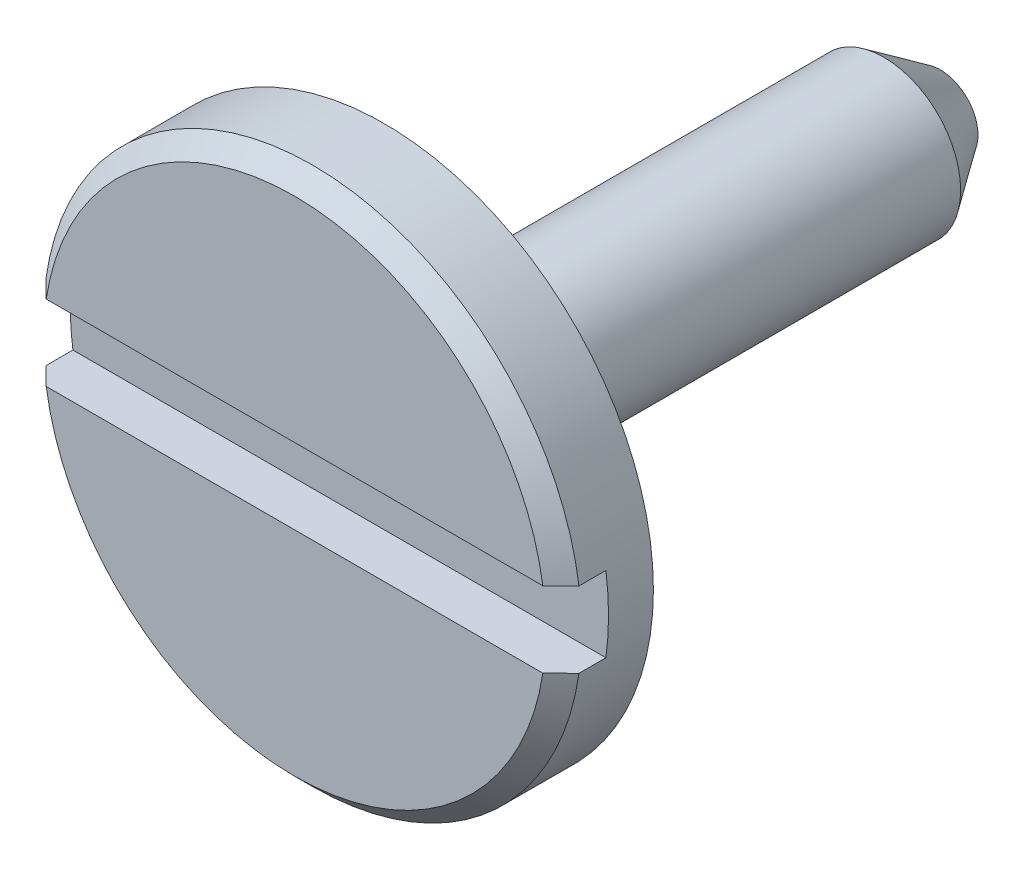
ISO-10303-21;
HEADER;
FILE_DESCRIPTION(('STEP AP214'),'2;1');
FILE_NAME('part.step','',(''),(''),'','','');
FILE_SCHEMA(('AUTOMOTIVE_DESIGN { 1 0 10303 214 1 1 1 1 }'));
ENDSEC;
DATA;
#1=APPLICATION_CONTEXT('core data for automotive mechanical design processes');
#2=APPLICATION_PROTOCOL_DEFINITION('international standard','automotive_design',2000,#1);
#3=PRODUCT_CONTEXT('',#1,'mechanical');
#4=PRODUCT('Part','Part','',(#3));
#5=PRODUCT_RELATED_PRODUCT_CATEGORY('part','',(#4));
#6=PRODUCT_DEFINITION_FORMATION('','',#4);
#7=PRODUCT_DEFINITION_CONTEXT('part definition',#1,'design');
#8=PRODUCT_DEFINITION('design','',#6,#7);
#9=PRODUCT_DEFINITION_SHAPE('','',#8);
#10=(LENGTH_UNIT() NAMED_UNIT(*) SI_UNIT(.MILLI.,.METRE.));
#11=(NAMED_UNIT(*) PLANE_ANGLE_UNIT() SI_UNIT($,.RADIAN.));
#12=(NAMED_UNIT(*) SI_UNIT($,.STERADIAN.) SOLID_ANGLE_UNIT());
#13=UNCERTAINTY_MEASURE_WITH_UNIT(LENGTH_MEASURE(1.E-05),#10,'distance_accuracy_value','');
#14=(GEOMETRIC_REPRESENTATION_CONTEXT(3) GLOBAL_UNCERTAINTY_ASSIGNED_CONTEXT((#13)) GLOBAL_UNIT_ASSIGNED_CONTEXT((#10,
#11,#12)) REPRESENTATION_CONTEXT('',''));
#15=CARTESIAN_POINT('',(0.,0.,0.));
#16=DIRECTION('',(0.,0.,1.));
#17=DIRECTION('',(1.,0.,0.));
#18=AXIS2_PLACEMENT_3D('',#15,#16,#17);
#19=CARTESIAN_POINT('',(-50.26622772217,-10.938681604222,15.5689026905811));
#20=DIRECTION('',(0.,0.,-1.));
#21=DIRECTION('',(-1.,0.,0.));
#22=AXIS2_PLACEMENT_3D('',#19,#20,#21);
#23=PLANE('',#22);
#24=CARTESIAN_POINT('',(-50.26622772217,-10.938681604222,15.5689026905811));
#25=DIRECTION('',(0.,0.,-1.));
#26=DIRECTION('',(-1.,0.,0.));
#27=AXIS2_PLACEMENT_3D('',#24,#25,#26);
#28=CIRCLE('',#27,0.732);
#29=CARTESIAN_POINT('',(-50.9909649892266,-11.0415396540619,15.5689026905811));
#30=VERTEX_POINT('',#29);
#31=CARTESIAN_POINT('',(-50.9909650687875,-10.8358235543796,15.5689026905811));
#32=VERTEX_POINT('',#31);
#33=EDGE_CURVE('E99',#30,#32,#28,.T.);
#34=ORIENTED_EDGE('',*,*,#33,.F.);
#35=DIRECTION('',(1.,0.,0.));
#36=VECTOR('',#35,1.);
#37=CARTESIAN_POINT('',(-50.26622772217,-11.0415396540619,15.5689026905811));
#38=LINE('',#37,#36);
#39=CARTESIAN_POINT('',(-49.541490375551,-11.0415396540619,15.5689026905811));
#40=VERTEX_POINT('',#39);
#41=EDGE_CURVE('E101',#30,#40,#38,.T.);
#42=ORIENTED_EDGE('',*,*,#41,.T.);
#43=CARTESIAN_POINT('',(-50.26622772217,-10.938681604222,15.5689026905811));
#44=DIRECTION('',(0.,0.,-1.));
#45=DIRECTION('',(-1.,0.,0.));
#46=AXIS2_PLACEMENT_3D('',#43,#44,#45);
#47=CIRCLE('',#46,0.732);
#48=CARTESIAN_POINT('',(-49.5414904551135,-10.8358235543796,15.5689026905811));
#49=VERTEX_POINT('',#48);
#50=EDGE_CURVE('E40',#49,#40,#47,.T.);
#51=ORIENTED_EDGE('',*,*,#50,.F.);
#52=DIRECTION('',(1.,0.,0.));
#53=VECTOR('',#52,1.);
#54=CARTESIAN_POINT('',(-50.26622772217,-10.8358235543796,15.5689026905811));
#55=LINE('',#54,#53);
#56=EDGE_CURVE('E118',#49,#32,#55,.F.);
#57=ORIENTED_EDGE('',*,*,#56,.T.);
#58=EDGE_LOOP('',(#34,#42,#51,#57));
#59=FACE_BOUND('',#58,.T.);
#60=ADVANCED_FACE('F37',(#59),#23,.F.);
#61=CARTESIAN_POINT('',(-50.26622772217,-10.8358235543796,15.5689026905811));
#62=DIRECTION('',(0.,1.,0.));
#63=DIRECTION('',(0.,0.,1.));
#64=AXIS2_PLACEMENT_3D('',#61,#62,#63);
#65=PLANE('',#64);
#66=ORIENTED_EDGE('',*,*,#56,.F.);
#67=DIRECTION('',(0.,0.,1.));
#68=VECTOR('',#67,1.);
#69=CARTESIAN_POINT('',(-49.5414905346749,-10.8358235543796,15.5689026905811));
#70=LINE('',#69,#68);
#71=CARTESIAN_POINT('',(-49.5414903755522,-10.8358235543796,15.6421026905805));
#72=VERTEX_POINT('',#71);
#73=EDGE_CURVE('E95',#72,#49,#70,.F.);
#74=ORIENTED_EDGE('',*,*,#73,.F.);
#75=CARTESIAN_POINT('',(-49.5908149138944,-10.8358235543796,15.6909026905805));
#76=CARTESIAN_POINT('',(-49.5825898081794,-10.8358235543796,15.6827711166603));
#77=CARTESIAN_POINT('',(-49.574366218234,-10.8358235543796,15.6746380106781));
#78=CARTESIAN_POINT('',(-49.5579220699022,-10.8358235543796,15.6583687346091));
#79=CARTESIAN_POINT('',(-49.5497015115157,-10.8358235543796,15.6502325645223));
#80=CARTESIAN_POINT('',(-49.5414824688989,-10.8358235543796,15.6420948623735));
#81=B_SPLINE_CURVE_WITH_KNOTS('',3,(#75,#76,#77,#78,#79,#80),.UNSPECIFIED.,.F.,.F.,(4,2,4),(0.,
0.0346983227341888,0.0693966453852883),.UNSPECIFIED.);
#82=CARTESIAN_POINT('',(-49.5908149138942,-10.8358235543796,15.6909026905803));
#83=VERTEX_POINT('',#82);
#84=EDGE_CURVE('E120',#83,#72,#81,.T.);
#85=ORIENTED_EDGE('',*,*,#84,.F.);
#86=DIRECTION('',(1.,0.,0.));
#87=VECTOR('',#86,1.);
#88=CARTESIAN_POINT('',(-49.90022772217,-10.8358235543796,15.6909026905811));
#89=LINE('',#88,#87);
#90=CARTESIAN_POINT('',(-50.9416405304458,-10.8358235543796,15.6909026905803));
#91=VERTEX_POINT('',#90);
#92=EDGE_CURVE('E108',#91,#83,#89,.T.);
#93=ORIENTED_EDGE('',*,*,#92,.F.);
#94=CARTESIAN_POINT('',(-50.9909730816409,-10.8358235543796,15.6420947572274));
#95=CARTESIAN_POINT('',(-50.9827540213364,-10.8358235543796,15.6502324769131));
#96=CARTESIAN_POINT('',(-50.9745334452562,-10.8358235543796,15.6583686645305));
#97=CARTESIAN_POINT('',(-50.9580892615244,-10.8358235543796,15.6746379756482));
#98=CARTESIAN_POINT('',(-50.9498656538729,-10.8358235543796,15.6827710991485));
#99=CARTESIAN_POINT('',(-50.9416405304456,-10.8358235543796,15.6909026905805));
#100=B_SPLINE_CURVE_WITH_KNOTS('',3,(#94,#95,#96,#97,#98,#99),.UNSPECIFIED.,.F.,.F.,(4,2,4),(0.,
0.0346983973740603,0.0693967948312197),.UNSPECIFIED.);
#101=CARTESIAN_POINT('',(-50.9909650687898,-10.8358235543796,15.6421026905786));
#102=VERTEX_POINT('',#101);
#103=EDGE_CURVE('E171',#102,#91,#100,.T.);
#104=ORIENTED_EDGE('',*,*,#103,.F.);
#105=DIRECTION('',(0.,0.,1.));
#106=VECTOR('',#105,1.);
#107=CARTESIAN_POINT('',(-50.9909650687873,-10.8358235543796,15.5689026905811));
#108=LINE('',#107,#106);
#109=EDGE_CURVE('E116',#32,#102,#108,.T.);
#110=ORIENTED_EDGE('',*,*,#109,.F.);
#111=EDGE_LOOP('',(#66,#74,#85,#93,#104,#110));
#112=FACE_BOUND('',#111,.T.);
#113=ADVANCED_FACE('F175',(#112),#65,.F.);
#114=CARTESIAN_POINT('',(-50.26622772217,-11.0415396540619,15.5689026905811));
#115=DIRECTION('',(0.,-1.,0.));
#116=DIRECTION('',(0.,0.,-1.));
#117=AXIS2_PLACEMENT_3D('',#114,#115,#116);
#118=PLANE('',#117);
#119=ORIENTED_EDGE('',*,*,#41,.F.);
#120=DIRECTION('',(0.,0.,-1.));
#121=VECTOR('',#120,1.);
#122=CARTESIAN_POINT('',(-50.9909649096651,-11.0415396540619,15.5689026905811));
#123=LINE('',#122,#121);
#124=CARTESIAN_POINT('',(-50.9909650687881,-11.0415396540619,15.6421026905805));
#125=VERTEX_POINT('',#124);
#126=EDGE_CURVE('E103',#125,#30,#123,.T.);
#127=ORIENTED_EDGE('',*,*,#126,.F.);
#128=CARTESIAN_POINT('',(-50.9416405304458,-11.0415396540619,15.6909026905806));
#129=CARTESIAN_POINT('',(-50.9498656361608,-11.0415396540619,15.6827711166604));
#130=CARTESIAN_POINT('',(-50.9580892261062,-11.0415396540619,15.6746380106782));
#131=CARTESIAN_POINT('',(-50.974533374438,-11.0415396540619,15.6583687346092));
#132=CARTESIAN_POINT('',(-50.9827539328245,-11.0415396540619,15.6502325645224));
#133=CARTESIAN_POINT('',(-50.9909729754414,-11.0415396540619,15.6420948623736));
#134=B_SPLINE_CURVE_WITH_KNOTS('',3,(#128,#129,#130,#131,#132,#133),.UNSPECIFIED.,.F.,.F.,(4,2,
4),(0.,0.0346983227342182,0.0693966453853323),.UNSPECIFIED.);
#135=CARTESIAN_POINT('',(-50.9416405304461,-11.0415396540619,15.6909026905804));
#136=VERTEX_POINT('',#135);
#137=EDGE_CURVE('E55',#136,#125,#134,.T.);
#138=ORIENTED_EDGE('',*,*,#137,.F.);
#139=DIRECTION('',(1.,0.,0.));
#140=VECTOR('',#139,1.);
#141=CARTESIAN_POINT('',(-49.90022772217,-11.0415396540619,15.6909026905811));
#142=LINE('',#141,#140);
#143=CARTESIAN_POINT('',(-49.5908149138939,-11.0415396540619,15.6909026905804));
#144=VERTEX_POINT('',#143);
#145=EDGE_CURVE('E111',#144,#136,#142,.F.);
#146=ORIENTED_EDGE('',*,*,#145,.F.);
#147=CARTESIAN_POINT('',(-49.5414823626974,-11.0415396540619,15.6420947572261));
#148=CARTESIAN_POINT('',(-49.5497014230021,-11.0415396540619,15.650232476912));
#149=CARTESIAN_POINT('',(-49.5579219990826,-11.0415396540619,15.6583686645297));
#150=CARTESIAN_POINT('',(-49.5743661828148,-11.0415396540619,15.6746379756478));
#151=CARTESIAN_POINT('',(-49.5825897904666,-11.0415396540619,15.6827710991484));
#152=CARTESIAN_POINT('',(-49.5908149138942,-11.0415396540619,15.6909026905806));
#153=B_SPLINE_CURVE_WITH_KNOTS('',3,(#147,#148,#149,#150,#151,#152),.UNSPECIFIED.,.F.,.F.,(4,2,
4),(0.,0.0346983973750881,0.0693967948332755),.UNSPECIFIED.);
#154=CARTESIAN_POINT('',(-49.5414903755501,-11.0415396540619,15.6421026905788));
#155=VERTEX_POINT('',#154);
#156=EDGE_CURVE('E107',#155,#144,#153,.T.);
#157=ORIENTED_EDGE('',*,*,#156,.F.);
#158=DIRECTION('',(0.,0.,-1.));
#159=VECTOR('',#158,1.);
#160=CARTESIAN_POINT('',(-49.5414903755503,-11.0415396540619,15.5689026905811));
#161=LINE('',#160,#159);
#162=EDGE_CURVE('E91',#40,#155,#161,.F.);
#163=ORIENTED_EDGE('',*,*,#162,.F.);
#164=EDGE_LOOP('',(#119,#127,#138,#146,#157,#163));
#165=FACE_BOUND('',#164,.T.);
#166=ADVANCED_FACE('F106',(#165),#118,.F.);
#167=CARTESIAN_POINT('',(-49.90022772217,-10.938681604222,15.6909026905811));
#168=DIRECTION('',(0.,0.,1.));
#169=DIRECTION('',(1.,0.,0.));
#170=AXIS2_PLACEMENT_3D('',#167,#168,#169);
#171=PLANE('',#170);
#172=ORIENTED_EDGE('',*,*,#92,.T.);
#173=CARTESIAN_POINT('',(-50.26622772217,-10.938681604222,15.6909026905801));
#174=DIRECTION('',(0.,0.,-1.));
#175=DIRECTION('',(-1.,0.,0.));
#176=AXIS2_PLACEMENT_3D('',#173,#174,#175);
#177=CIRCLE('',#176,0.683200000000429);
#178=EDGE_CURVE('E135',#91,#83,#177,.T.);
#179=ORIENTED_EDGE('',*,*,#178,.F.);
#180=EDGE_LOOP('',(#172,#179));
#181=FACE_BOUND('',#180,.T.);
#182=ADVANCED_FACE('F184',(#181),#171,.T.);
#183=CARTESIAN_POINT('',(-49.90022772217,-10.938681604222,15.6909026905811));
#184=DIRECTION('',(0.,0.,1.));
#185=DIRECTION('',(1.,0.,0.));
#186=AXIS2_PLACEMENT_3D('',#183,#184,#185);
#187=PLANE('',#186);
#188=ORIENTED_EDGE('',*,*,#145,.T.);
#189=CARTESIAN_POINT('',(-50.26622772217,-10.938681604222,15.6909026905801));
#190=DIRECTION('',(0.,0.,-1.));
#191=DIRECTION('',(-1.,0.,0.));
#192=AXIS2_PLACEMENT_3D('',#189,#190,#191);
#193=CIRCLE('',#192,0.683200000000429);
#194=EDGE_CURVE('E132',#144,#136,#193,.T.);
#195=ORIENTED_EDGE('',*,*,#194,.F.);
#196=EDGE_LOOP('',(#188,#195));
#197=FACE_BOUND('',#196,.T.);
#198=ADVANCED_FACE('F211',(#197),#187,.T.);
#199=CARTESIAN_POINT('',(-50.2150435457344,-10.938681604222,13.9344871517934));
#200=DIRECTION('',(0.,0.,-1.));
#201=DIRECTION('',(-1.,0.,0.));
#202=AXIS2_PLACEMENT_3D('',#199,#200,#201);
#203=PLANE('',#202);
#204=CARTESIAN_POINT('',(-50.26622772217,-10.938681604222,13.9344871517995));
#205=DIRECTION('',(0.,0.,1.));
#206=DIRECTION('',(1.,0.,0.));
#207=AXIS2_PLACEMENT_3D('',#204,#205,#206);
#208=CIRCLE('',#207,0.102368352873076);
#209=CARTESIAN_POINT('',(-50.1638593692969,-10.938681604222,13.9344871517995));
#210=VERTEX_POINT('',#209);
#211=EDGE_CURVE('E129',#210,#210,#208,.T.);
#212=ORIENTED_EDGE('',*,*,#211,.F.);
#213=EDGE_LOOP('',(#212));
#214=FACE_BOUND('',#213,.T.);
#215=ADVANCED_FACE('F163',(#214),#203,.T.);
#216=CARTESIAN_POINT('',(-50.26622772217,-10.938681604222,15.6420947031998));
#217=DIRECTION('',(0.,0.,-1.));
#218=DIRECTION('',(-1.,0.,0.));
#219=AXIS2_PLACEMENT_3D('',#216,#217,#218);
#220=CONICAL_SURFACE('',#219,0.732007987380744,0.785398163397448);
#221=ORIENTED_EDGE('',*,*,#178,.T.);
#222=ORIENTED_EDGE('',*,*,#84,.T.);
#223=CARTESIAN_POINT('',(-50.26622772217,-10.938681604222,15.6421026905805));
#224=DIRECTION('',(0.,0.,-1.));
#225=DIRECTION('',(-1.,0.,0.));
#226=AXIS2_PLACEMENT_3D('',#223,#224,#225);
#227=CIRCLE('',#226,0.732);
#228=EDGE_CURVE('E127',#102,#72,#227,.T.);
#229=ORIENTED_EDGE('',*,*,#228,.F.);
#230=ORIENTED_EDGE('',*,*,#103,.T.);
#231=EDGE_LOOP('',(#221,#222,#229,#230));
#232=FACE_BOUND('',#231,.T.);
#233=ADVANCED_FACE('F156',(#232),#220,.T.);
#234=CARTESIAN_POINT('',(-50.26622772217,-10.938681604222,15.6420947031998));
#235=DIRECTION('',(0.,0.,-1.));
#236=DIRECTION('',(-1.,0.,0.));
#237=AXIS2_PLACEMENT_3D('',#234,#235,#236);
#238=CONICAL_SURFACE('',#237,0.732007987380744,0.785398163397448);
#239=ORIENTED_EDGE('',*,*,#194,.T.);
#240=ORIENTED_EDGE('',*,*,#137,.T.);
#241=CARTESIAN_POINT('',(-50.26622772217,-10.938681604222,15.6421026905805));
#242=DIRECTION('',(0.,0.,-1.));
#243=DIRECTION('',(-1.,0.,0.));
#244=AXIS2_PLACEMENT_3D('',#241,#242,#243);
#245=CIRCLE('',#244,0.732);
#246=EDGE_CURVE('E125',#155,#125,#245,.T.);
#247=ORIENTED_EDGE('',*,*,#246,.F.);
#248=ORIENTED_EDGE('',*,*,#156,.T.);
#249=EDGE_LOOP('',(#239,#240,#247,#248));
#250=FACE_BOUND('',#249,.T.);
#251=ADVANCED_FACE('F150',(#250),#238,.T.);
#252=CARTESIAN_POINT('',(-50.26622772217,-10.938681604222,14.0880760472926));
#253=DIRECTION('',(0.,0.,1.));
#254=DIRECTION('',(1.,0.,0.));
#255=AXIS2_PLACEMENT_3D('',#252,#253,#254);
#256=CONICAL_SURFACE('',#255,0.208742024915669,0.605733449515699);
#257=CARTESIAN_POINT('',(-50.26622772217,-10.938681604222,14.0880760472638));
#258=DIRECTION('',(0.,0.,-1.));
#259=DIRECTION('',(-1.,0.,0.));
#260=AXIS2_PLACEMENT_3D('',#257,#258,#259);
#261=CIRCLE('',#260,0.208742024898541);
#262=CARTESIAN_POINT('',(-50.4749697470685,-10.938681604222,14.0880760472638));
#263=VERTEX_POINT('',#262);
#264=EDGE_CURVE('E124',#263,#263,#261,.F.);
#265=ORIENTED_EDGE('',*,*,#264,.F.);
#266=EDGE_LOOP('',(#265));
#267=FACE_BOUND('',#266,.T.);
#268=ORIENTED_EDGE('',*,*,#211,.T.);
#269=EDGE_LOOP('',(#268));
#270=FACE_BOUND('',#269,.T.);
#271=ADVANCED_FACE('F155',(#267,#270),#256,.T.);
#272=CARTESIAN_POINT('',(-50.26622772217,-10.938681604222,15.5689026905811));
#273=DIRECTION('',(0.,0.,-1.));
#274=DIRECTION('',(-1.,0.,0.));
#275=AXIS2_PLACEMENT_3D('',#272,#273,#274);
#276=CYLINDRICAL_SURFACE('',#275,0.732);
#277=CARTESIAN_POINT('',(-50.26622772217,-10.938681604222,15.4469026905811));
#278=DIRECTION('',(0.,0.,-1.));
#279=DIRECTION('',(-1.,0.,0.));
#280=AXIS2_PLACEMENT_3D('',#277,#278,#279);
#281=CIRCLE('',#280,0.732);
#282=CARTESIAN_POINT('',(-50.99822772217,-10.938681604222,15.4469026905811));
#283=VERTEX_POINT('',#282);
#284=EDGE_CURVE('E46',#283,#283,#281,.T.);
#285=ORIENTED_EDGE('',*,*,#284,.F.);
#286=EDGE_LOOP('',(#285));
#287=FACE_BOUND('',#286,.T.);
#288=ORIENTED_EDGE('',*,*,#162,.T.);
#289=ORIENTED_EDGE('',*,*,#246,.T.);
#290=ORIENTED_EDGE('',*,*,#126,.T.);
#291=ORIENTED_EDGE('',*,*,#33,.T.);
#292=ORIENTED_EDGE('',*,*,#109,.T.);
#293=ORIENTED_EDGE('',*,*,#228,.T.);
#294=ORIENTED_EDGE('',*,*,#73,.T.);
#295=ORIENTED_EDGE('',*,*,#50,.T.);
#296=EDGE_LOOP('',(#288,#289,#290,#291,#292,#293,#294,#295));
#297=FACE_BOUND('',#296,.T.);
#298=ADVANCED_FACE('F88',(#287,#297),#276,.T.);
#299=CARTESIAN_POINT('',(-50.26622772217,-10.938681604222,14.7674893689224));
#300=DIRECTION('',(0.,0.,-1.));
#301=DIRECTION('',(-1.,0.,0.));
#302=AXIS2_PLACEMENT_3D('',#299,#300,#301);
#303=CYLINDRICAL_SURFACE('',#302,0.208742024898541);
#304=CARTESIAN_POINT('',(-50.26622772217,-10.938681604222,15.4469026905811));
#305=DIRECTION('',(0.,0.,-1.));
#306=DIRECTION('',(-1.,0.,0.));
#307=AXIS2_PLACEMENT_3D('',#304,#305,#306);
#308=CIRCLE('',#307,0.208742024898541);
#309=CARTESIAN_POINT('',(-50.4749697470685,-10.938681604222,15.4469026905811));
#310=VERTEX_POINT('',#309);
#311=EDGE_CURVE('E11',#310,#310,#308,.F.);
#312=ORIENTED_EDGE('',*,*,#311,.F.);
#313=EDGE_LOOP('',(#312));
#314=FACE_BOUND('',#313,.T.);
#315=ORIENTED_EDGE('',*,*,#264,.T.);
#316=EDGE_LOOP('',(#315));
#317=FACE_BOUND('',#316,.T.);
#318=ADVANCED_FACE('F187',(#314,#317),#303,.T.);
#319=CARTESIAN_POINT('',(-49.7958567097211,-10.938681604222,15.4469026905811));
#320=DIRECTION('',(0.,0.,-1.));
#321=DIRECTION('',(-1.,0.,0.));
#322=AXIS2_PLACEMENT_3D('',#319,#320,#321);
#323=PLANE('',#322);
#324=ORIENTED_EDGE('',*,*,#311,.T.);
#325=EDGE_LOOP('',(#324));
#326=FACE_BOUND('',#325,.T.);
#327=ORIENTED_EDGE('',*,*,#284,.T.);
#328=EDGE_LOOP('',(#327));
#329=FACE_BOUND('',#328,.T.);
#330=ADVANCED_FACE('F185',(#326,#329),#323,.T.);
#331=CLOSED_SHELL('',(#60,#113,#166,#182,#198,#215,#233,#251,#271,#298,#318,#330));
#332=MANIFOLD_SOLID_BREP('B2',#331);
#333=ADVANCED_BREP_SHAPE_REPRESENTATION('',(#18,#332),#14);
#334=SHAPE_DEFINITION_REPRESENTATION(#9,#333);
ENDSEC;
END-ISO-10303-21;
